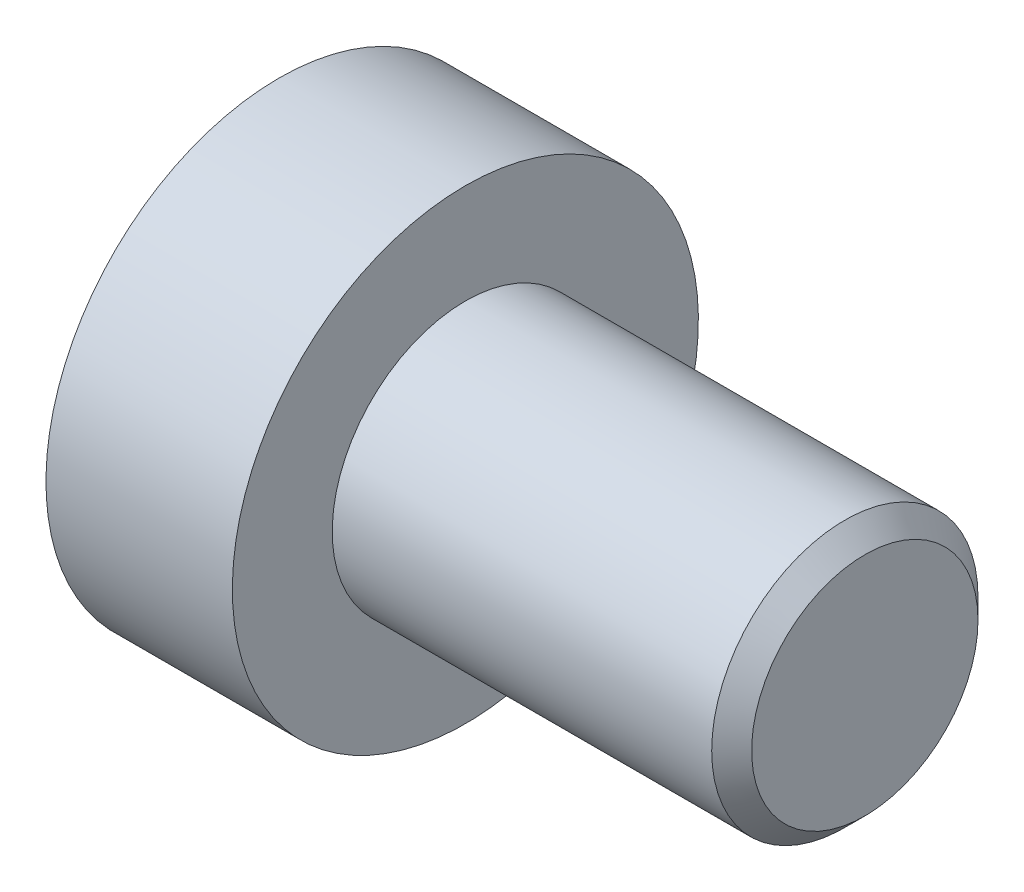
ISO-10303-21;
HEADER;
FILE_DESCRIPTION(('STEP AP214'),'2;1');
FILE_NAME('part.step','',(''),(''),'','','');
FILE_SCHEMA(('AUTOMOTIVE_DESIGN { 1 0 10303 214 1 1 1 1 }'));
ENDSEC;
DATA;
#1=APPLICATION_CONTEXT('core data for automotive mechanical design processes');
#2=APPLICATION_PROTOCOL_DEFINITION('international standard','automotive_design',2000,#1);
#3=PRODUCT_CONTEXT('',#1,'mechanical');
#4=PRODUCT('Part','Part','',(#3));
#5=PRODUCT_RELATED_PRODUCT_CATEGORY('part','',(#4));
#6=PRODUCT_DEFINITION_FORMATION('','',#4);
#7=PRODUCT_DEFINITION_CONTEXT('part definition',#1,'design');
#8=PRODUCT_DEFINITION('design','',#6,#7);
#9=PRODUCT_DEFINITION_SHAPE('','',#8);
#10=(LENGTH_UNIT() NAMED_UNIT(*) SI_UNIT(.MILLI.,.METRE.));
#11=(NAMED_UNIT(*) PLANE_ANGLE_UNIT() SI_UNIT($,.RADIAN.));
#12=(NAMED_UNIT(*) SI_UNIT($,.STERADIAN.) SOLID_ANGLE_UNIT());
#13=UNCERTAINTY_MEASURE_WITH_UNIT(LENGTH_MEASURE(1.E-05),#10,'distance_accuracy_value','');
#14=(GEOMETRIC_REPRESENTATION_CONTEXT(3) GLOBAL_UNCERTAINTY_ASSIGNED_CONTEXT((#13)) GLOBAL_UNIT_ASSIGNED_CONTEXT((#10,
#11,#12)) REPRESENTATION_CONTEXT('',''));
#15=CARTESIAN_POINT('',(0.,0.,0.));
#16=DIRECTION('',(0.,0.,1.));
#17=DIRECTION('',(1.,0.,0.));
#18=AXIS2_PLACEMENT_3D('',#15,#16,#17);
#19=CARTESIAN_POINT('',(-6.,0.,0.));
#20=DIRECTION('',(1.,0.,0.));
#21=DIRECTION('',(0.,0.,-1.));
#22=AXIS2_PLACEMENT_3D('',#19,#20,#21);
#23=CYLINDRICAL_SURFACE('',#22,2.);
#24=CARTESIAN_POINT('',(-0.300000000000003,0.,0.));
#25=DIRECTION('',(1.,0.,0.));
#26=DIRECTION('',(0.,0.,-1.));
#27=AXIS2_PLACEMENT_3D('',#24,#25,#26);
#28=CIRCLE('',#27,2.);
#29=CARTESIAN_POINT('',(-0.300000000000003,0.,-2.));
#30=VERTEX_POINT('',#29);
#31=EDGE_CURVE('E47',#30,#30,#28,.F.);
#32=ORIENTED_EDGE('',*,*,#31,.T.);
#33=EDGE_LOOP('',(#32));
#34=FACE_BOUND('',#33,.T.);
#35=CARTESIAN_POINT('',(-6.,0.,0.));
#36=DIRECTION('',(1.,0.,0.));
#37=DIRECTION('',(0.,1.,0.));
#38=AXIS2_PLACEMENT_3D('',#35,#36,#37);
#39=CIRCLE('',#38,2.);
#40=CARTESIAN_POINT('',(-6.,1.99999999999999,0.));
#41=VERTEX_POINT('',#40);
#42=EDGE_CURVE('E123',#41,#41,#39,.F.);
#43=ORIENTED_EDGE('',*,*,#42,.F.);
#44=EDGE_LOOP('',(#43));
#45=FACE_BOUND('',#44,.T.);
#46=ADVANCED_FACE('F34',(#34,#45),#23,.T.);
#47=CARTESIAN_POINT('',(0.,0.,0.));
#48=DIRECTION('',(1.,0.,0.));
#49=DIRECTION('',(0.,0.,-1.));
#50=AXIS2_PLACEMENT_3D('',#47,#48,#49);
#51=PLANE('',#50);
#52=CARTESIAN_POINT('',(0.,0.,0.));
#53=DIRECTION('',(1.,0.,0.));
#54=DIRECTION('',(0.,0.,-1.));
#55=AXIS2_PLACEMENT_3D('',#52,#53,#54);
#56=CIRCLE('',#55,1.7);
#57=CARTESIAN_POINT('',(0.,0.,-1.7));
#58=VERTEX_POINT('',#57);
#59=EDGE_CURVE('E126',#58,#58,#56,.T.);
#60=ORIENTED_EDGE('',*,*,#59,.T.);
#61=EDGE_LOOP('',(#60));
#62=FACE_BOUND('',#61,.T.);
#63=ADVANCED_FACE('F136',(#62),#51,.T.);
#64=CARTESIAN_POINT('',(0.,0.,0.));
#65=DIRECTION('',(-1.,0.,0.));
#66=DIRECTION('',(0.,0.,1.));
#67=AXIS2_PLACEMENT_3D('',#64,#65,#66);
#68=CONICAL_SURFACE('',#67,1.7,0.785398163397444);
#69=ORIENTED_EDGE('',*,*,#31,.F.);
#70=EDGE_LOOP('',(#69));
#71=FACE_BOUND('',#70,.T.);
#72=ORIENTED_EDGE('',*,*,#59,.F.);
#73=EDGE_LOOP('',(#72));
#74=FACE_BOUND('',#73,.T.);
#75=ADVANCED_FACE('F36',(#71,#74),#68,.T.);
#76=CARTESIAN_POINT('',(-8.8,0.,0.));
#77=DIRECTION('',(-1.,0.,0.));
#78=DIRECTION('',(0.,-1.,0.));
#79=AXIS2_PLACEMENT_3D('',#76,#77,#78);
#80=PLANE('',#79);
#81=CARTESIAN_POINT('',(-8.8,0.,0.));
#82=DIRECTION('',(-1.,0.,0.));
#83=DIRECTION('',(0.,-1.,0.));
#84=AXIS2_PLACEMENT_3D('',#81,#82,#83);
#85=CIRCLE('',#84,1.49337567297408);
#86=CARTESIAN_POINT('',(-8.80000000000001,-1.49337567297405,0.));
#87=VERTEX_POINT('',#86);
#88=EDGE_CURVE('E236',#87,#87,#85,.T.);
#89=ORIENTED_EDGE('',*,*,#88,.F.);
#90=EDGE_LOOP('',(#89));
#91=FACE_BOUND('',#90,.T.);
#92=CARTESIAN_POINT('',(-8.8,0.,0.));
#93=DIRECTION('',(1.,0.,0.));
#94=DIRECTION('',(0.,1.,0.));
#95=AXIS2_PLACEMENT_3D('',#92,#93,#94);
#96=CIRCLE('',#95,3.5);
#97=CARTESIAN_POINT('',(-8.8,3.5,0.));
#98=VERTEX_POINT('',#97);
#99=EDGE_CURVE('E120',#98,#98,#96,.T.);
#100=ORIENTED_EDGE('',*,*,#99,.F.);
#101=EDGE_LOOP('',(#100));
#102=FACE_BOUND('',#101,.T.);
#103=ADVANCED_FACE('F135',(#91,#102),#80,.T.);
#104=CARTESIAN_POINT('',(-6.,0.,0.));
#105=DIRECTION('',(1.,0.,0.));
#106=DIRECTION('',(0.,1.,0.));
#107=AXIS2_PLACEMENT_3D('',#104,#105,#106);
#108=CYLINDRICAL_SURFACE('',#107,3.5);
#109=ORIENTED_EDGE('',*,*,#99,.T.);
#110=EDGE_LOOP('',(#109));
#111=FACE_BOUND('',#110,.T.);
#112=CARTESIAN_POINT('',(-6.,0.,0.));
#113=DIRECTION('',(1.,0.,0.));
#114=DIRECTION('',(0.,1.,0.));
#115=AXIS2_PLACEMENT_3D('',#112,#113,#114);
#116=CIRCLE('',#115,3.5);
#117=CARTESIAN_POINT('',(-6.,3.5,0.));
#118=VERTEX_POINT('',#117);
#119=EDGE_CURVE('E117',#118,#118,#116,.T.);
#120=ORIENTED_EDGE('',*,*,#119,.F.);
#121=EDGE_LOOP('',(#120));
#122=FACE_BOUND('',#121,.T.);
#123=ADVANCED_FACE('F147',(#111,#122),#108,.T.);
#124=CARTESIAN_POINT('',(-6.,3.5,0.));
#125=DIRECTION('',(1.,0.,0.));
#126=DIRECTION('',(0.,1.,0.));
#127=AXIS2_PLACEMENT_3D('',#124,#125,#126);
#128=PLANE('',#127);
#129=ORIENTED_EDGE('',*,*,#42,.T.);
#130=EDGE_LOOP('',(#129));
#131=FACE_BOUND('',#130,.T.);
#132=ORIENTED_EDGE('',*,*,#119,.T.);
#133=EDGE_LOOP('',(#132));
#134=FACE_BOUND('',#133,.T.);
#135=ADVANCED_FACE('F151',(#131,#134),#128,.T.);
#136=CARTESIAN_POINT('',(-8.8,0.,0.));
#137=DIRECTION('',(-1.,0.,0.));
#138=DIRECTION('',(0.,-1.,0.));
#139=AXIS2_PLACEMENT_3D('',#136,#137,#138);
#140=CONICAL_SURFACE('',#139,1.49337567297408,0.78539816339745);
#141=ORIENTED_EDGE('',*,*,#88,.T.);
#142=EDGE_LOOP('',(#141));
#143=FACE_BOUND('',#142,.T.);
#144=CARTESIAN_POINT('',(-9.20140216898837,-1.42396736984798,1.25));
#145=CARTESIAN_POINT('',(-9.17529613644805,-1.38922450814775,1.25));
#146=CARTESIAN_POINT('',(-9.14945065634314,-1.35428640192996,1.25));
#147=CARTESIAN_POINT('',(-9.09838791202342,-1.28394100441963,1.25));
#148=CARTESIAN_POINT('',(-9.07317080935882,-1.24853359598577,1.25));
#149=CARTESIAN_POINT('',(-8.99826335395112,-1.1409714001612,1.25));
#150=CARTESIAN_POINT('',(-8.94971904359717,-1.0680049582675,1.25));
#151=CARTESIAN_POINT('',(-8.85456001629848,-0.915095472420351,1.25));
#152=CARTESIAN_POINT('',(-8.80820303826042,-0.834990154954495,1.25));
#153=CARTESIAN_POINT('',(-8.72350392700248,-0.670798348959412,1.25));
#154=CARTESIAN_POINT('',(-8.68513479787227,-0.58672648793716,1.25));
#155=CARTESIAN_POINT('',(-8.63819850204759,-0.460385334768697,1.25));
#156=CARTESIAN_POINT('',(-8.62470212076981,-0.419954113336603,1.25));
#157=CARTESIAN_POINT('',(-8.60095730744747,-0.338129031291281,1.25));
#158=CARTESIAN_POINT('',(-8.5907091035293,-0.296735103284174,1.25));
#159=CARTESIAN_POINT('',(-8.57415946635525,-0.213916243687788,1.25));
#160=CARTESIAN_POINT('',(-8.56779133855251,-0.172504848949336,1.25));
#161=CARTESIAN_POINT('',(-8.55912371966082,-0.0892560954741928,1.25));
#162=CARTESIAN_POINT('',(-8.55682355999816,-0.0474188078703005,1.25));
#163=CARTESIAN_POINT('',(-8.55645641051935,0.0348235296905066,1.25));
#164=CARTESIAN_POINT('',(-8.55824554854156,0.0752279922916836,1.25));
#165=CARTESIAN_POINT('',(-8.56564480351348,0.155687005579612,1.25));
#166=CARTESIAN_POINT('',(-8.57125566297007,0.195741486737967,1.25));
#167=CARTESIAN_POINT('',(-8.5860898151071,0.275882483894674,1.25));
#168=CARTESIAN_POINT('',(-8.59537388954039,0.315957579678778,1.25));
#169=CARTESIAN_POINT('',(-8.61706569649922,0.395234027395286,1.25));
#170=CARTESIAN_POINT('',(-8.62947314897842,0.434435457318926,1.25));
#171=CARTESIAN_POINT('',(-8.6734108304631,0.558570325397125,1.25));
#172=CARTESIAN_POINT('',(-8.70997441432895,0.641718054005946,1.25));
#173=CARTESIAN_POINT('',(-8.79124788730661,0.804100725662088,1.25));
#174=CARTESIAN_POINT('',(-8.83598718952972,0.883320183915878,1.25));
#175=CARTESIAN_POINT('',(-8.92826522864606,1.03470895505823,1.25));
#176=CARTESIAN_POINT('',(-8.97555343888178,1.10703287925038,1.25));
#177=CARTESIAN_POINT('',(-9.04864632092525,1.21358798649191,1.25));
#178=CARTESIAN_POINT('',(-9.07326644329957,1.24864609054882,1.25));
#179=CARTESIAN_POINT('',(-9.12315526013102,1.31828380805649,1.25));
#180=CARTESIAN_POINT('',(-9.14842377580172,1.35286354944694,1.25));
#181=CARTESIAN_POINT('',(-9.17396105811685,1.38724419886388,1.25));
#182=B_SPLINE_CURVE_WITH_KNOTS('',3,(#144,#145,#146,#147,#148,#149,#150,#151,#152,#153,#154,
#155,#156,#157,#158,#159,#160,#161,#162,#163,#164,#165,#166,#167,#168,#169,#170,#171,#172,#173,
#174,#175,#176,#177,#178,#179,#180,#181),.UNSPECIFIED.,.F.,.F.,(4,2,2,2,2,2,2,2,2,2,2,2,2,2,2,2,
2,2,4),(0.,0.130370422461748,0.260774023229279,0.523571931962181,0.800995227642792,
1.07746514553942,1.20522972687283,1.33300327939672,1.45851355132216,1.5840031936199,
1.70514602294322,1.82631239533597,1.94957373840992,2.07282403363807,2.34451838945522,
2.61721016161585,2.87631588769062,3.00482945023601,3.13330794967362),.UNSPECIFIED.);
#183=CARTESIAN_POINT('',(-8.74999999999999,-0.721687836486998,1.25));
#184=VERTEX_POINT('',#183);
#185=CARTESIAN_POINT('',(-8.74999999999998,0.721687836487067,1.25));
#186=VERTEX_POINT('',#185);
#187=EDGE_CURVE('E101',#184,#186,#182,.T.);
#188=ORIENTED_EDGE('',*,*,#187,.F.);
#189=CARTESIAN_POINT('',(-8.75011548390912,-1.44349114302787,-0.000200000000000523));
#190=CARTESIAN_POINT('',(-8.72532166805509,-1.41867941875062,0.0427751670715866));
#191=CARTESIAN_POINT('',(-8.70198373441867,-1.3934527698074,0.086469004745948));
#192=CARTESIAN_POINT('',(-8.65925200408452,-1.34201263554191,0.175565930841942));
#193=CARTESIAN_POINT('',(-8.6398819923604,-1.31579425481273,0.220977498357063));
#194=CARTESIAN_POINT('',(-8.60670048341346,-1.26292610442243,0.312547820935259));
#195=CARTESIAN_POINT('',(-8.59280555905264,-1.23628980770468,0.358683240175885));
#196=CARTESIAN_POINT('',(-8.57139728216062,-1.18243062538505,0.451970080407591));
#197=CARTESIAN_POINT('',(-8.56386794156677,-1.15520938653758,0.499118649136379));
#198=CARTESIAN_POINT('',(-8.55707449805069,-1.10829684367464,0.580373556887251));
#199=CARTESIAN_POINT('',(-8.55606855910434,-1.08866617256955,0.61437487662794));
#200=CARTESIAN_POINT('',(-8.55776141491131,-1.04943932800608,0.682317764432476));
#201=CARTESIAN_POINT('',(-8.56046102721552,-1.02984316311596,0.716259317655657));
#202=CARTESIAN_POINT('',(-8.56940893031636,-0.990839954603466,0.783814856457499));
#203=CARTESIAN_POINT('',(-8.57566052589969,-0.971433104248738,0.817428507286774));
#204=CARTESIAN_POINT('',(-8.59137568141389,-0.932943395609872,0.884094638217812));
#205=CARTESIAN_POINT('',(-8.60084062008744,-0.913860680098267,0.917146871030295));
#206=CARTESIAN_POINT('',(-8.62893139068757,-0.864986351354534,1.00179969160026));
#207=CARTESIAN_POINT('',(-8.64967015745219,-0.835502920149042,1.05286649242964));
#208=CARTESIAN_POINT('',(-8.69638713467146,-0.777690319475875,1.15300085411325));
#209=CARTESIAN_POINT('',(-8.72234829594675,-0.749357745598383,1.20207431157827));
#210=CARTESIAN_POINT('',(-8.75011548390912,-0.72157236643316,1.2502));
#211=B_SPLINE_CURVE_WITH_KNOTS('',3,(#189,#190,#191,#192,#193,#194,#195,#196,#197,#198,#199,
#200,#201,#202,#203,#204,#205,#206,#207,#208,#209,#210),.UNSPECIFIED.,.F.,.F.,(4,2,2,2,2,2,2,2,
2,2,4),(0.,0.166533409618304,0.334037607289761,0.498880396489698,0.663307919240274,
0.780963963458826,0.898645970148452,1.01643764860773,1.13427993171549,1.32148652032141,
1.50809158792573),.UNSPECIFIED.);
#212=CARTESIAN_POINT('',(-8.74999999999999,-1.44337567297403,0.));
#213=VERTEX_POINT('',#212);
#214=EDGE_CURVE('E193',#213,#184,#211,.T.);
#215=ORIENTED_EDGE('',*,*,#214,.F.);
#216=CARTESIAN_POINT('',(-8.75011548390912,-0.72157236643316,-1.2502));
#217=CARTESIAN_POINT('',(-8.72532166805509,-0.74638409071041,-1.20722483292841));
#218=CARTESIAN_POINT('',(-8.70198373441867,-0.77161073965363,-1.16353099525405));
#219=CARTESIAN_POINT('',(-8.65925200408452,-0.82305087391912,-1.07443406915806));
#220=CARTESIAN_POINT('',(-8.6398819923604,-0.849269254648299,-1.02902250164294));
#221=CARTESIAN_POINT('',(-8.60670048341346,-0.902137405038601,-0.937452179064741));
#222=CARTESIAN_POINT('',(-8.59280555905264,-0.928773701756353,-0.891316759824115));
#223=CARTESIAN_POINT('',(-8.57139728216062,-0.982632884075978,-0.798029919592408));
#224=CARTESIAN_POINT('',(-8.56386794156677,-1.00985412292345,-0.750881350863621));
#225=CARTESIAN_POINT('',(-8.55707449805069,-1.05676666578639,-0.669626443112748));
#226=CARTESIAN_POINT('',(-8.55606855910434,-1.07639733689148,-0.63562512337206));
#227=CARTESIAN_POINT('',(-8.55776141491131,-1.11562418145495,-0.567682235567523));
#228=CARTESIAN_POINT('',(-8.56046102721552,-1.13522034634507,-0.533740682344343));
#229=CARTESIAN_POINT('',(-8.56940893031636,-1.17422355485756,-0.466185143542501));
#230=CARTESIAN_POINT('',(-8.57566052589969,-1.19363040521229,-0.432571492713226));
#231=CARTESIAN_POINT('',(-8.59137568141389,-1.23212011385116,-0.365905361782188));
#232=CARTESIAN_POINT('',(-8.60084062008744,-1.25120282936276,-0.332853128969705));
#233=CARTESIAN_POINT('',(-8.62893139068757,-1.30007715810649,-0.248200308399737));
#234=CARTESIAN_POINT('',(-8.64967015745219,-1.32956058931199,-0.197133507570363));
#235=CARTESIAN_POINT('',(-8.69638713467146,-1.38737318998515,-0.0969991458867464));
#236=CARTESIAN_POINT('',(-8.72234829594676,-1.41570576386264,-0.0479256884217317));
#237=CARTESIAN_POINT('',(-8.75011548390912,-1.44349114302787,0.000199999999999044));
#238=B_SPLINE_CURVE_WITH_KNOTS('',3,(#216,#217,#218,#219,#220,#221,#222,#223,#224,#225,#226,
#227,#228,#229,#230,#231,#232,#233,#234,#235,#236,#237),.UNSPECIFIED.,.F.,.F.,(4,2,2,2,2,2,2,2,
2,2,4),(0.,0.166533409618303,0.334037607289761,0.498880396489697,0.663307919240273,
0.780963963458825,0.898645970148451,1.01643764860773,1.13427993171549,1.32148652032141,
1.50809158792573),.UNSPECIFIED.);
#239=CARTESIAN_POINT('',(-8.74999999999999,-0.721687836486998,-1.25));
#240=VERTEX_POINT('',#239);
#241=EDGE_CURVE('E188',#240,#213,#238,.T.);
#242=ORIENTED_EDGE('',*,*,#241,.F.);
#243=CARTESIAN_POINT('',(-9.20140216898837,-1.42396736984798,-1.25));
#244=CARTESIAN_POINT('',(-9.17529613644804,-1.38922450814774,-1.25));
#245=CARTESIAN_POINT('',(-9.14945065634314,-1.35428640192996,-1.25));
#246=CARTESIAN_POINT('',(-9.09838791202342,-1.28394100441962,-1.25));
#247=CARTESIAN_POINT('',(-9.07317080935881,-1.24853359598576,-1.25));
#248=CARTESIAN_POINT('',(-8.99826335395112,-1.14097140016119,-1.25));
#249=CARTESIAN_POINT('',(-8.94971904359717,-1.0680049582675,-1.25));
#250=CARTESIAN_POINT('',(-8.85456001629848,-0.91509547242035,-1.25));
#251=CARTESIAN_POINT('',(-8.80820303826042,-0.834990154954493,-1.25));
#252=CARTESIAN_POINT('',(-8.72350392700248,-0.670798348959409,-1.25));
#253=CARTESIAN_POINT('',(-8.68513479787227,-0.586726487937158,-1.25));
#254=CARTESIAN_POINT('',(-8.63819850204759,-0.460385334768696,-1.25));
#255=CARTESIAN_POINT('',(-8.62470212076981,-0.419954113336601,-1.25));
#256=CARTESIAN_POINT('',(-8.60095730744747,-0.33812903129128,-1.25));
#257=CARTESIAN_POINT('',(-8.5907091035293,-0.296735103284173,-1.25));
#258=CARTESIAN_POINT('',(-8.57415946635525,-0.213916243687787,-1.25));
#259=CARTESIAN_POINT('',(-8.56779133855251,-0.172504848949335,-1.25));
#260=CARTESIAN_POINT('',(-8.55912371966082,-0.0892560954741923,-1.25));
#261=CARTESIAN_POINT('',(-8.55682355999816,-0.0474188078703002,-1.25));
#262=CARTESIAN_POINT('',(-8.55645641051935,0.0348235296905068,-1.25));
#263=CARTESIAN_POINT('',(-8.55824554854156,0.0752279922916837,-1.25));
#264=CARTESIAN_POINT('',(-8.56564480351348,0.155687005579612,-1.25));
#265=CARTESIAN_POINT('',(-8.57125566297007,0.195741486737967,-1.25));
#266=CARTESIAN_POINT('',(-8.5860898151071,0.275882483894674,-1.25));
#267=CARTESIAN_POINT('',(-8.59537388954039,0.315957579678778,-1.25));
#268=CARTESIAN_POINT('',(-8.61706569649922,0.395234027395286,-1.25));
#269=CARTESIAN_POINT('',(-8.62947314897842,0.434435457318926,-1.25));
#270=CARTESIAN_POINT('',(-8.6734108304631,0.558570325397125,-1.25));
#271=CARTESIAN_POINT('',(-8.70997441432895,0.641718054005946,-1.25));
#272=CARTESIAN_POINT('',(-8.79124788730661,0.804100725662087,-1.25));
#273=CARTESIAN_POINT('',(-8.83598718952972,0.883320183915878,-1.25));
#274=CARTESIAN_POINT('',(-8.92826522864606,1.03470895505823,-1.25));
#275=CARTESIAN_POINT('',(-8.97555343888178,1.10703287925038,-1.25));
#276=CARTESIAN_POINT('',(-9.04864632092525,1.21358798649191,-1.25));
#277=CARTESIAN_POINT('',(-9.07326644329957,1.24864609054882,-1.25));
#278=CARTESIAN_POINT('',(-9.12315526013102,1.31828380805649,-1.25));
#279=CARTESIAN_POINT('',(-9.14842377580172,1.35286354944694,-1.25));
#280=CARTESIAN_POINT('',(-9.17396105811685,1.38724419886388,-1.25));
#281=B_SPLINE_CURVE_WITH_KNOTS('',3,(#243,#244,#245,#246,#247,#248,#249,#250,#251,#252,#253,
#254,#255,#256,#257,#258,#259,#260,#261,#262,#263,#264,#265,#266,#267,#268,#269,#270,#271,#272,
#273,#274,#275,#276,#277,#278,#279,#280),.UNSPECIFIED.,.F.,.F.,(4,2,2,2,2,2,2,2,2,2,2,2,2,2,2,2,
2,2,4),(0.,0.130370422461749,0.26077402322928,0.523571931962181,0.800995227642793,
1.07746514553942,1.20522972687283,1.33300327939672,1.45851355132216,1.5840031936199,
1.70514602294322,1.82631239533597,1.94957373840992,2.07282403363807,2.34451838945522,
2.61721016161585,2.87631588769062,3.004829450236,3.13330794967362),.UNSPECIFIED.);
#282=CARTESIAN_POINT('',(-8.74999999999998,0.721687836487067,-1.25));
#283=VERTEX_POINT('',#282);
#284=EDGE_CURVE('E54',#283,#240,#281,.F.);
#285=ORIENTED_EDGE('',*,*,#284,.F.);
#286=CARTESIAN_POINT('',(-8.75011548390911,1.44349114302794,0.000200000000000746));
#287=CARTESIAN_POINT('',(-8.72532166805508,1.41867941875069,-0.0427751670715857));
#288=CARTESIAN_POINT('',(-8.70198373441866,1.39345276980747,-0.0864690047459471));
#289=CARTESIAN_POINT('',(-8.65925200408451,1.34201263554198,-0.175565930841941));
#290=CARTESIAN_POINT('',(-8.63988199236039,1.3157942548128,-0.220977498357063));
#291=CARTESIAN_POINT('',(-8.60670048341346,1.26292610442249,-0.312547820935259));
#292=CARTESIAN_POINT('',(-8.59280555905263,1.23628980770474,-0.358683240175885));
#293=CARTESIAN_POINT('',(-8.57139728216062,1.18243062538512,-0.451970080407592));
#294=CARTESIAN_POINT('',(-8.56386794156676,1.15520938653765,-0.499118649136379));
#295=CARTESIAN_POINT('',(-8.55707449805068,1.1082968436747,-0.580373556887252));
#296=CARTESIAN_POINT('',(-8.55606855910433,1.08866617256961,-0.61437487662794));
#297=CARTESIAN_POINT('',(-8.5577614149113,1.04943932800614,-0.682317764432477));
#298=CARTESIAN_POINT('',(-8.56046102721552,1.02984316311603,-0.716259317655657));
#299=CARTESIAN_POINT('',(-8.56940893031636,0.990839954603533,-0.783814856457499));
#300=CARTESIAN_POINT('',(-8.57566052589968,0.971433104248805,-0.817428507286774));
#301=CARTESIAN_POINT('',(-8.59137568141388,0.932943395609939,-0.884094638217812));
#302=CARTESIAN_POINT('',(-8.60084062008744,0.913860680098334,-0.917146871030295));
#303=CARTESIAN_POINT('',(-8.62893139068757,0.864986351354602,-1.00179969160026));
#304=CARTESIAN_POINT('',(-8.64967015745218,0.83550292014911,-1.05286649242964));
#305=CARTESIAN_POINT('',(-8.69638713467145,0.777690319475943,-1.15300085411325));
#306=CARTESIAN_POINT('',(-8.72234829594674,0.749357745598451,-1.20207431157827));
#307=CARTESIAN_POINT('',(-8.75011548390911,0.721572366433229,-1.2502));
#308=B_SPLINE_CURVE_WITH_KNOTS('',3,(#286,#287,#288,#289,#290,#291,#292,#293,#294,#295,#296,
#297,#298,#299,#300,#301,#302,#303,#304,#305,#306,#307),.UNSPECIFIED.,.F.,.F.,(4,2,2,2,2,2,2,2,
2,2,4),(0.,0.166533409618304,0.334037607289762,0.498880396489699,0.663307919240275,
0.780963963458827,0.898645970148453,1.01643764860773,1.1342799317155,1.32148652032141,
1.50809158792574),.UNSPECIFIED.);
#309=CARTESIAN_POINT('',(-8.74999999999998,1.4433756729741,0.));
#310=VERTEX_POINT('',#309);
#311=EDGE_CURVE('E11',#310,#283,#308,.T.);
#312=ORIENTED_EDGE('',*,*,#311,.F.);
#313=CARTESIAN_POINT('',(-8.75011548390911,0.721572366433229,1.2502));
#314=CARTESIAN_POINT('',(-8.72532166805508,0.746384090710478,1.20722483292841));
#315=CARTESIAN_POINT('',(-8.70198373441866,0.771610739653699,1.16353099525405));
#316=CARTESIAN_POINT('',(-8.65925200408452,0.823050873919189,1.07443406915806));
#317=CARTESIAN_POINT('',(-8.63988199236039,0.849269254648367,1.02902250164294));
#318=CARTESIAN_POINT('',(-8.60670048341346,0.902137405038669,0.93745217906474));
#319=CARTESIAN_POINT('',(-8.59280555905263,0.92877370175642,0.891316759824115));
#320=CARTESIAN_POINT('',(-8.57139728216062,0.982632884076045,0.798029919592408));
#321=CARTESIAN_POINT('',(-8.56386794156676,1.00985412292352,0.750881350863621));
#322=CARTESIAN_POINT('',(-8.55707449805068,1.05676666578646,0.669626443112749));
#323=CARTESIAN_POINT('',(-8.55606855910433,1.07639733689155,0.63562512337206));
#324=CARTESIAN_POINT('',(-8.5577614149113,1.11562418145502,0.567682235567524));
#325=CARTESIAN_POINT('',(-8.56046102721552,1.13522034634514,0.533740682344343));
#326=CARTESIAN_POINT('',(-8.56940893031635,1.17422355485763,0.466185143542501));
#327=CARTESIAN_POINT('',(-8.57566052589968,1.19363040521236,0.432571492713226));
#328=CARTESIAN_POINT('',(-8.59137568141388,1.23212011385122,0.365905361782188));
#329=CARTESIAN_POINT('',(-8.60084062008744,1.25120282936283,0.332853128969706));
#330=CARTESIAN_POINT('',(-8.62893139068756,1.30007715810656,0.248200308399737));
#331=CARTESIAN_POINT('',(-8.64967015745218,1.32956058931205,0.197133507570363));
#332=CARTESIAN_POINT('',(-8.69638713467145,1.38737318998522,0.0969991458867466));
#333=CARTESIAN_POINT('',(-8.72234829594674,1.41570576386271,0.0479256884217319));
#334=CARTESIAN_POINT('',(-8.75011548390911,1.44349114302794,-0.000199999999998879));
#335=B_SPLINE_CURVE_WITH_KNOTS('',3,(#313,#314,#315,#316,#317,#318,#319,#320,#321,#322,#323,
#324,#325,#326,#327,#328,#329,#330,#331,#332,#333,#334),.UNSPECIFIED.,.F.,.F.,(4,2,2,2,2,2,2,2,
2,2,4),(0.,0.166533409618303,0.334037607289761,0.498880396489696,0.663307919240272,
0.780963963458825,0.898645970148451,1.01643764860773,1.13427993171549,1.32148652032141,
1.50809158792573),.UNSPECIFIED.);
#336=EDGE_CURVE('E92',#186,#310,#335,.T.);
#337=ORIENTED_EDGE('',*,*,#336,.F.);
#338=EDGE_LOOP('',(#188,#215,#242,#285,#312,#337));
#339=FACE_BOUND('',#338,.T.);
#340=ADVANCED_FACE('F91',(#143,#339),#140,.F.);
#341=CARTESIAN_POINT('',(-7.2,0.,0.));
#342=DIRECTION('',(-1.,0.,0.));
#343=DIRECTION('',(0.,-1.,0.));
#344=AXIS2_PLACEMENT_3D('',#341,#342,#343);
#345=PLANE('',#344);
#346=DIRECTION('',(0.,0.5,-0.866025403784439));
#347=VECTOR('',#346,1.);
#348=CARTESIAN_POINT('',(-7.2,0.721687836487061,1.25));
#349=LINE('',#348,#347);
#350=CARTESIAN_POINT('',(-7.2,0.721687836487061,1.25));
#351=VERTEX_POINT('',#350);
#352=CARTESIAN_POINT('',(-7.2,1.44337567297409,0.));
#353=VERTEX_POINT('',#352);
#354=EDGE_CURVE('E100',#351,#353,#349,.T.);
#355=ORIENTED_EDGE('',*,*,#354,.T.);
#356=DIRECTION('',(0.,-0.5,-0.866025403784439));
#357=VECTOR('',#356,1.);
#358=CARTESIAN_POINT('',(-7.2,1.44337567297409,0.));
#359=LINE('',#358,#357);
#360=CARTESIAN_POINT('',(-7.2,0.721687836487061,-1.25));
#361=VERTEX_POINT('',#360);
#362=EDGE_CURVE('E105',#353,#361,#359,.T.);
#363=ORIENTED_EDGE('',*,*,#362,.T.);
#364=DIRECTION('',(0.,-1.,0.));
#365=VECTOR('',#364,1.);
#366=CARTESIAN_POINT('',(-7.2,0.721687836487061,-1.25));
#367=LINE('',#366,#365);
#368=CARTESIAN_POINT('',(-7.2,-0.721687836487003,-1.25));
#369=VERTEX_POINT('',#368);
#370=EDGE_CURVE('E218',#361,#369,#367,.T.);
#371=ORIENTED_EDGE('',*,*,#370,.T.);
#372=DIRECTION('',(0.,-0.5,0.866025403784439));
#373=VECTOR('',#372,1.);
#374=CARTESIAN_POINT('',(-7.2,-0.721687836487003,-1.25));
#375=LINE('',#374,#373);
#376=CARTESIAN_POINT('',(-7.20000000000001,-1.44337567297404,0.));
#377=VERTEX_POINT('',#376);
#378=EDGE_CURVE('E222',#369,#377,#375,.T.);
#379=ORIENTED_EDGE('',*,*,#378,.T.);
#380=DIRECTION('',(0.,0.5,0.866025403784439));
#381=VECTOR('',#380,1.);
#382=CARTESIAN_POINT('',(-7.20000000000001,-1.44337567297404,0.));
#383=LINE('',#382,#381);
#384=CARTESIAN_POINT('',(-7.2,-0.721687836487004,1.25));
#385=VERTEX_POINT('',#384);
#386=EDGE_CURVE('E113',#377,#385,#383,.T.);
#387=ORIENTED_EDGE('',*,*,#386,.T.);
#388=DIRECTION('',(0.,1.,0.));
#389=VECTOR('',#388,1.);
#390=CARTESIAN_POINT('',(-7.2,-0.721687836487004,1.25));
#391=LINE('',#390,#389);
#392=EDGE_CURVE('E108',#385,#351,#391,.T.);
#393=ORIENTED_EDGE('',*,*,#392,.T.);
#394=EDGE_LOOP('',(#355,#363,#371,#379,#387,#393));
#395=FACE_BOUND('',#394,.T.);
#396=ADVANCED_FACE('F175',(#395),#345,.T.);
#397=CARTESIAN_POINT('',(-7.2,1.44337567297409,0.));
#398=DIRECTION('',(0.,0.866025403784439,-0.5));
#399=DIRECTION('',(0.,0.5,0.866025403784439));
#400=AXIS2_PLACEMENT_3D('',#397,#398,#399);
#401=PLANE('',#400);
#402=DIRECTION('',(-1.,0.,0.));
#403=VECTOR('',#402,1.);
#404=CARTESIAN_POINT('',(-7.2,1.44337567297409,0.));
#405=LINE('',#404,#403);
#406=EDGE_CURVE('E98',#353,#310,#405,.T.);
#407=ORIENTED_EDGE('',*,*,#406,.T.);
#408=ORIENTED_EDGE('',*,*,#311,.T.);
#409=DIRECTION('',(-1.,0.,0.));
#410=VECTOR('',#409,1.);
#411=CARTESIAN_POINT('',(-7.2,0.721687836487061,-1.25));
#412=LINE('',#411,#410);
#413=EDGE_CURVE('E107',#361,#283,#412,.T.);
#414=ORIENTED_EDGE('',*,*,#413,.F.);
#415=ORIENTED_EDGE('',*,*,#362,.F.);
#416=EDGE_LOOP('',(#407,#408,#414,#415));
#417=FACE_BOUND('',#416,.T.);
#418=ADVANCED_FACE('F103',(#417),#401,.F.);
#419=CARTESIAN_POINT('',(-7.2,0.721687836487061,-1.25));
#420=DIRECTION('',(0.,0.,-1.));
#421=DIRECTION('',(-1.,0.,0.));
#422=AXIS2_PLACEMENT_3D('',#419,#420,#421);
#423=PLANE('',#422);
#424=ORIENTED_EDGE('',*,*,#413,.T.);
#425=ORIENTED_EDGE('',*,*,#284,.T.);
#426=DIRECTION('',(-1.,0.,0.));
#427=VECTOR('',#426,1.);
#428=CARTESIAN_POINT('',(-7.2,-0.721687836487003,-1.25));
#429=LINE('',#428,#427);
#430=EDGE_CURVE('E110',#369,#240,#429,.T.);
#431=ORIENTED_EDGE('',*,*,#430,.F.);
#432=ORIENTED_EDGE('',*,*,#370,.F.);
#433=EDGE_LOOP('',(#424,#425,#431,#432));
#434=FACE_BOUND('',#433,.T.);
#435=ADVANCED_FACE('F207',(#434),#423,.F.);
#436=CARTESIAN_POINT('',(-7.2,-0.721687836487003,-1.25));
#437=DIRECTION('',(0.,-0.866025403784439,-0.5));
#438=DIRECTION('',(0.,0.5,-0.866025403784439));
#439=AXIS2_PLACEMENT_3D('',#436,#437,#438);
#440=PLANE('',#439);
#441=ORIENTED_EDGE('',*,*,#430,.T.);
#442=ORIENTED_EDGE('',*,*,#241,.T.);
#443=DIRECTION('',(-1.,0.,0.));
#444=VECTOR('',#443,1.);
#445=CARTESIAN_POINT('',(-7.20000000000001,-1.44337567297404,0.));
#446=LINE('',#445,#444);
#447=EDGE_CURVE('E232',#377,#213,#446,.T.);
#448=ORIENTED_EDGE('',*,*,#447,.F.);
#449=ORIENTED_EDGE('',*,*,#378,.F.);
#450=EDGE_LOOP('',(#441,#442,#448,#449));
#451=FACE_BOUND('',#450,.T.);
#452=ADVANCED_FACE('F202',(#451),#440,.F.);
#453=CARTESIAN_POINT('',(-7.20000000000001,-1.44337567297404,0.));
#454=DIRECTION('',(0.,-0.866025403784439,0.5));
#455=DIRECTION('',(0.,-0.5,-0.866025403784439));
#456=AXIS2_PLACEMENT_3D('',#453,#454,#455);
#457=PLANE('',#456);
#458=ORIENTED_EDGE('',*,*,#447,.T.);
#459=ORIENTED_EDGE('',*,*,#214,.T.);
#460=DIRECTION('',(-1.,0.,0.));
#461=VECTOR('',#460,1.);
#462=CARTESIAN_POINT('',(-7.2,-0.721687836487004,1.25));
#463=LINE('',#462,#461);
#464=EDGE_CURVE('E229',#385,#184,#463,.T.);
#465=ORIENTED_EDGE('',*,*,#464,.F.);
#466=ORIENTED_EDGE('',*,*,#386,.F.);
#467=EDGE_LOOP('',(#458,#459,#465,#466));
#468=FACE_BOUND('',#467,.T.);
#469=ADVANCED_FACE('F199',(#468),#457,.F.);
#470=CARTESIAN_POINT('',(-7.2,-0.721687836487004,1.25));
#471=DIRECTION('',(0.,0.,1.));
#472=DIRECTION('',(1.,0.,0.));
#473=AXIS2_PLACEMENT_3D('',#470,#471,#472);
#474=PLANE('',#473);
#475=ORIENTED_EDGE('',*,*,#464,.T.);
#476=ORIENTED_EDGE('',*,*,#187,.T.);
#477=DIRECTION('',(-1.,0.,0.));
#478=VECTOR('',#477,1.);
#479=CARTESIAN_POINT('',(-7.2,0.721687836487061,1.25));
#480=LINE('',#479,#478);
#481=EDGE_CURVE('E61',#351,#186,#480,.T.);
#482=ORIENTED_EDGE('',*,*,#481,.F.);
#483=ORIENTED_EDGE('',*,*,#392,.F.);
#484=EDGE_LOOP('',(#475,#476,#482,#483));
#485=FACE_BOUND('',#484,.T.);
#486=ADVANCED_FACE('F158',(#485),#474,.F.);
#487=CARTESIAN_POINT('',(-7.2,0.721687836487061,1.25));
#488=DIRECTION('',(0.,0.866025403784439,0.5));
#489=DIRECTION('',(0.,-0.5,0.866025403784439));
#490=AXIS2_PLACEMENT_3D('',#487,#488,#489);
#491=PLANE('',#490);
#492=ORIENTED_EDGE('',*,*,#481,.T.);
#493=ORIENTED_EDGE('',*,*,#336,.T.);
#494=ORIENTED_EDGE('',*,*,#406,.F.);
#495=ORIENTED_EDGE('',*,*,#354,.F.);
#496=EDGE_LOOP('',(#492,#493,#494,#495));
#497=FACE_BOUND('',#496,.T.);
#498=ADVANCED_FACE('F97',(#497),#491,.F.);
#499=CLOSED_SHELL('',(#46,#63,#75,#103,#123,#135,#340,#396,#418,#435,#452,#469,#486,#498));
#500=MANIFOLD_SOLID_BREP('B2',#499);
#501=ADVANCED_BREP_SHAPE_REPRESENTATION('',(#18,#500),#14);
#502=SHAPE_DEFINITION_REPRESENTATION(#9,#501);
ENDSEC;
END-ISO-10303-21;
